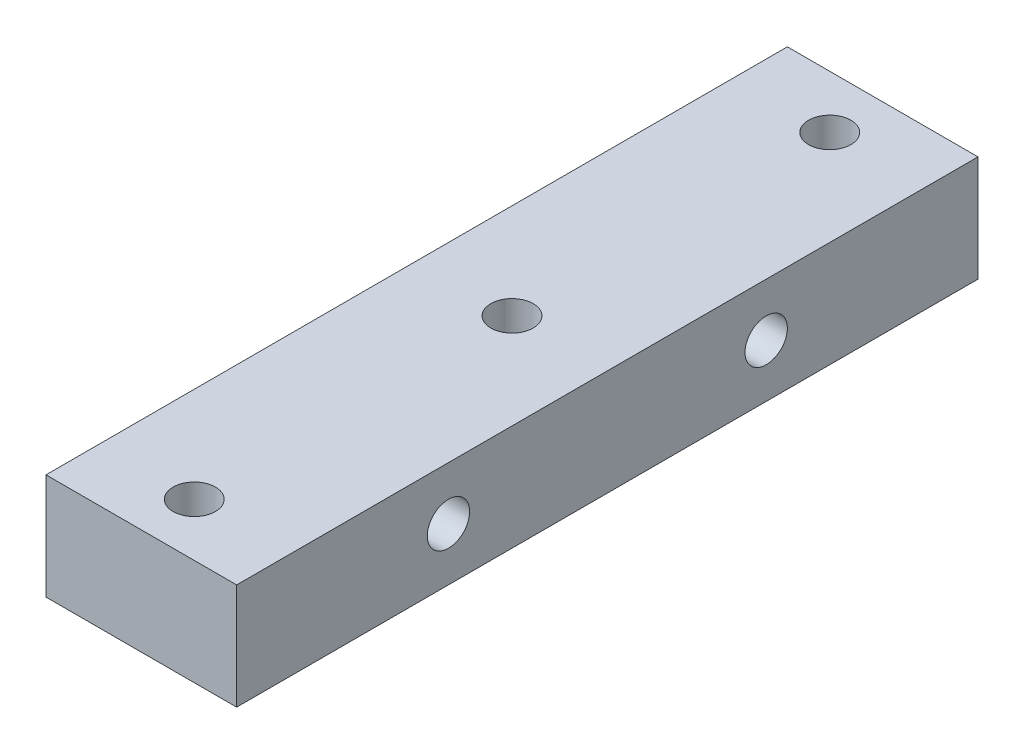
ISO-10303-21;
HEADER;
FILE_DESCRIPTION(('STEP AP214'),'2;1');
FILE_NAME('part.step','',(''),(''),'','','');
FILE_SCHEMA(('AUTOMOTIVE_DESIGN { 1 0 10303 214 1 1 1 1 }'));
ENDSEC;
DATA;
#1=APPLICATION_CONTEXT('core data for automotive mechanical design processes');
#2=APPLICATION_PROTOCOL_DEFINITION('international standard','automotive_design',2000,#1);
#3=PRODUCT_CONTEXT('',#1,'mechanical');
#4=PRODUCT('Part','Part','',(#3));
#5=PRODUCT_RELATED_PRODUCT_CATEGORY('part','',(#4));
#6=PRODUCT_DEFINITION_FORMATION('','',#4);
#7=PRODUCT_DEFINITION_CONTEXT('part definition',#1,'design');
#8=PRODUCT_DEFINITION('design','',#6,#7);
#9=PRODUCT_DEFINITION_SHAPE('','',#8);
#10=(LENGTH_UNIT() NAMED_UNIT(*) SI_UNIT(.MILLI.,.METRE.));
#11=(NAMED_UNIT(*) PLANE_ANGLE_UNIT() SI_UNIT($,.RADIAN.));
#12=(NAMED_UNIT(*) SI_UNIT($,.STERADIAN.) SOLID_ANGLE_UNIT());
#13=UNCERTAINTY_MEASURE_WITH_UNIT(LENGTH_MEASURE(1.E-05),#10,'distance_accuracy_value','');
#14=(GEOMETRIC_REPRESENTATION_CONTEXT(3) GLOBAL_UNCERTAINTY_ASSIGNED_CONTEXT((#13)) GLOBAL_UNIT_ASSIGNED_CONTEXT((#10,
#11,#12)) REPRESENTATION_CONTEXT('',''));
#15=CARTESIAN_POINT('',(0.,0.,0.));
#16=DIRECTION('',(0.,0.,1.));
#17=DIRECTION('',(1.,0.,0.));
#18=AXIS2_PLACEMENT_3D('',#15,#16,#17);
#19=CARTESIAN_POINT('',(9.,5.,70.));
#20=DIRECTION('',(-1.,0.,0.));
#21=DIRECTION('',(0.,0.,1.));
#22=AXIS2_PLACEMENT_3D('',#19,#20,#21);
#23=PLANE('',#22);
#24=CARTESIAN_POINT('',(9.,0.,50.));
#25=DIRECTION('',(1.,0.,0.));
#26=DIRECTION('',(0.,0.,-1.));
#27=AXIS2_PLACEMENT_3D('',#24,#25,#26);
#28=CIRCLE('',#27,2.);
#29=CARTESIAN_POINT('',(9.,0.,48.));
#30=VERTEX_POINT('',#29);
#31=EDGE_CURVE('E139',#30,#30,#28,.T.);
#32=ORIENTED_EDGE('',*,*,#31,.F.);
#33=EDGE_LOOP('',(#32));
#34=FACE_BOUND('',#33,.T.);
#35=CARTESIAN_POINT('',(9.,0.,20.));
#36=DIRECTION('',(1.,0.,0.));
#37=DIRECTION('',(0.,0.,1.));
#38=AXIS2_PLACEMENT_3D('',#35,#36,#37);
#39=CIRCLE('',#38,2.);
#40=CARTESIAN_POINT('',(9.,0.,22.));
#41=VERTEX_POINT('',#40);
#42=EDGE_CURVE('E133',#41,#41,#39,.T.);
#43=ORIENTED_EDGE('',*,*,#42,.F.);
#44=EDGE_LOOP('',(#43));
#45=FACE_BOUND('',#44,.T.);
#46=DIRECTION('',(0.,1.,0.));
#47=VECTOR('',#46,1.);
#48=CARTESIAN_POINT('',(9.,5.,0.));
#49=LINE('',#48,#47);
#50=CARTESIAN_POINT('',(9.,-5.,0.));
#51=VERTEX_POINT('',#50);
#52=CARTESIAN_POINT('',(9.,5.,0.));
#53=VERTEX_POINT('',#52);
#54=EDGE_CURVE('E101',#51,#53,#49,.T.);
#55=ORIENTED_EDGE('',*,*,#54,.T.);
#56=DIRECTION('',(0.,0.,-1.));
#57=VECTOR('',#56,1.);
#58=CARTESIAN_POINT('',(9.,5.,70.));
#59=LINE('',#58,#57);
#60=CARTESIAN_POINT('',(9.,5.,70.));
#61=VERTEX_POINT('',#60);
#62=EDGE_CURVE('E11',#61,#53,#59,.T.);
#63=ORIENTED_EDGE('',*,*,#62,.F.);
#64=DIRECTION('',(0.,1.,0.));
#65=VECTOR('',#64,1.);
#66=CARTESIAN_POINT('',(9.,5.,70.));
#67=LINE('',#66,#65);
#68=CARTESIAN_POINT('',(9.,-5.,70.));
#69=VERTEX_POINT('',#68);
#70=EDGE_CURVE('E89',#69,#61,#67,.T.);
#71=ORIENTED_EDGE('',*,*,#70,.F.);
#72=DIRECTION('',(0.,0.,-1.));
#73=VECTOR('',#72,1.);
#74=CARTESIAN_POINT('',(9.,-5.,70.));
#75=LINE('',#74,#73);
#76=EDGE_CURVE('E97',#69,#51,#75,.T.);
#77=ORIENTED_EDGE('',*,*,#76,.T.);
#78=EDGE_LOOP('',(#55,#63,#71,#77));
#79=FACE_BOUND('',#78,.T.);
#80=ADVANCED_FACE('F38',(#34,#45,#79),#23,.F.);
#81=CARTESIAN_POINT('',(-9.,5.,70.));
#82=DIRECTION('',(0.,-1.,0.));
#83=DIRECTION('',(0.,0.,-1.));
#84=AXIS2_PLACEMENT_3D('',#81,#82,#83);
#85=PLANE('',#84);
#86=CARTESIAN_POINT('',(0.,5.,5.));
#87=DIRECTION('',(0.,1.,0.));
#88=DIRECTION('',(0.,0.,1.));
#89=AXIS2_PLACEMENT_3D('',#86,#87,#88);
#90=CIRCLE('',#89,2.);
#91=CARTESIAN_POINT('',(0.,5.,7.));
#92=VERTEX_POINT('',#91);
#93=EDGE_CURVE('E128',#92,#92,#90,.T.);
#94=ORIENTED_EDGE('',*,*,#93,.F.);
#95=EDGE_LOOP('',(#94));
#96=FACE_BOUND('',#95,.T.);
#97=CARTESIAN_POINT('',(0.,5.,35.));
#98=DIRECTION('',(0.,1.,0.));
#99=DIRECTION('',(0.,0.,1.));
#100=AXIS2_PLACEMENT_3D('',#97,#98,#99);
#101=CIRCLE('',#100,2.);
#102=CARTESIAN_POINT('',(0.,5.,37.));
#103=VERTEX_POINT('',#102);
#104=EDGE_CURVE('E122',#103,#103,#101,.T.);
#105=ORIENTED_EDGE('',*,*,#104,.F.);
#106=EDGE_LOOP('',(#105));
#107=FACE_BOUND('',#106,.T.);
#108=CARTESIAN_POINT('',(0.,5.,65.));
#109=DIRECTION('',(0.,1.,0.));
#110=DIRECTION('',(0.,0.,-1.));
#111=AXIS2_PLACEMENT_3D('',#108,#109,#110);
#112=CIRCLE('',#111,2.);
#113=CARTESIAN_POINT('',(0.,5.,63.));
#114=VERTEX_POINT('',#113);
#115=EDGE_CURVE('E115',#114,#114,#112,.T.);
#116=ORIENTED_EDGE('',*,*,#115,.F.);
#117=EDGE_LOOP('',(#116));
#118=FACE_BOUND('',#117,.T.);
#119=DIRECTION('',(-1.,0.,0.));
#120=VECTOR('',#119,1.);
#121=CARTESIAN_POINT('',(-9.,5.,0.));
#122=LINE('',#121,#120);
#123=CARTESIAN_POINT('',(-9.,5.,0.));
#124=VERTEX_POINT('',#123);
#125=EDGE_CURVE('E93',#53,#124,#122,.T.);
#126=ORIENTED_EDGE('',*,*,#125,.T.);
#127=DIRECTION('',(0.,0.,-1.));
#128=VECTOR('',#127,1.);
#129=CARTESIAN_POINT('',(-9.,5.,70.));
#130=LINE('',#129,#128);
#131=CARTESIAN_POINT('',(-9.,5.,70.));
#132=VERTEX_POINT('',#131);
#133=EDGE_CURVE('E46',#132,#124,#130,.T.);
#134=ORIENTED_EDGE('',*,*,#133,.F.);
#135=DIRECTION('',(-1.,0.,0.));
#136=VECTOR('',#135,1.);
#137=CARTESIAN_POINT('',(-9.,5.,70.));
#138=LINE('',#137,#136);
#139=EDGE_CURVE('E84',#61,#132,#138,.T.);
#140=ORIENTED_EDGE('',*,*,#139,.F.);
#141=ORIENTED_EDGE('',*,*,#62,.T.);
#142=EDGE_LOOP('',(#126,#134,#140,#141));
#143=FACE_BOUND('',#142,.T.);
#144=ADVANCED_FACE('F92',(#96,#107,#118,#143),#85,.F.);
#145=CARTESIAN_POINT('',(-9.,5.,70.));
#146=DIRECTION('',(1.,0.,0.));
#147=DIRECTION('',(0.,0.,-1.));
#148=AXIS2_PLACEMENT_3D('',#145,#146,#147);
#149=PLANE('',#148);
#150=CARTESIAN_POINT('',(-9.,0.,50.));
#151=DIRECTION('',(1.,0.,0.));
#152=DIRECTION('',(0.,0.,-1.));
#153=AXIS2_PLACEMENT_3D('',#150,#151,#152);
#154=CIRCLE('',#153,2.);
#155=CARTESIAN_POINT('',(-9.,0.,48.));
#156=VERTEX_POINT('',#155);
#157=EDGE_CURVE('E119',#156,#156,#154,.T.);
#158=ORIENTED_EDGE('',*,*,#157,.T.);
#159=EDGE_LOOP('',(#158));
#160=FACE_BOUND('',#159,.T.);
#161=CARTESIAN_POINT('',(-9.,0.,20.));
#162=DIRECTION('',(1.,0.,0.));
#163=DIRECTION('',(0.,0.,1.));
#164=AXIS2_PLACEMENT_3D('',#161,#162,#163);
#165=CIRCLE('',#164,2.);
#166=CARTESIAN_POINT('',(-9.,0.,22.));
#167=VERTEX_POINT('',#166);
#168=EDGE_CURVE('E136',#167,#167,#165,.T.);
#169=ORIENTED_EDGE('',*,*,#168,.T.);
#170=EDGE_LOOP('',(#169));
#171=FACE_BOUND('',#170,.T.);
#172=DIRECTION('',(0.,-1.,0.));
#173=VECTOR('',#172,1.);
#174=CARTESIAN_POINT('',(-9.,5.,0.));
#175=LINE('',#174,#173);
#176=CARTESIAN_POINT('',(-9.,-5.,0.));
#177=VERTEX_POINT('',#176);
#178=EDGE_CURVE('E71',#124,#177,#175,.T.);
#179=ORIENTED_EDGE('',*,*,#178,.T.);
#180=DIRECTION('',(0.,0.,-1.));
#181=VECTOR('',#180,1.);
#182=CARTESIAN_POINT('',(-9.,-5.,70.));
#183=LINE('',#182,#181);
#184=CARTESIAN_POINT('',(-9.,-5.,70.));
#185=VERTEX_POINT('',#184);
#186=EDGE_CURVE('E94',#185,#177,#183,.T.);
#187=ORIENTED_EDGE('',*,*,#186,.F.);
#188=DIRECTION('',(0.,-1.,0.));
#189=VECTOR('',#188,1.);
#190=CARTESIAN_POINT('',(-9.,5.,70.));
#191=LINE('',#190,#189);
#192=EDGE_CURVE('E87',#132,#185,#191,.T.);
#193=ORIENTED_EDGE('',*,*,#192,.F.);
#194=ORIENTED_EDGE('',*,*,#133,.T.);
#195=EDGE_LOOP('',(#179,#187,#193,#194));
#196=FACE_BOUND('',#195,.T.);
#197=ADVANCED_FACE('F95',(#160,#171,#196),#149,.F.);
#198=CARTESIAN_POINT('',(-9.,-5.,70.));
#199=DIRECTION('',(0.,1.,0.));
#200=DIRECTION('',(0.,0.,1.));
#201=AXIS2_PLACEMENT_3D('',#198,#199,#200);
#202=PLANE('',#201);
#203=CARTESIAN_POINT('',(0.,-5.,5.));
#204=DIRECTION('',(0.,1.,0.));
#205=DIRECTION('',(0.,0.,1.));
#206=AXIS2_PLACEMENT_3D('',#203,#204,#205);
#207=CIRCLE('',#206,2.);
#208=CARTESIAN_POINT('',(0.,-5.,7.));
#209=VERTEX_POINT('',#208);
#210=EDGE_CURVE('E104',#209,#209,#207,.T.);
#211=ORIENTED_EDGE('',*,*,#210,.T.);
#212=EDGE_LOOP('',(#211));
#213=FACE_BOUND('',#212,.T.);
#214=CARTESIAN_POINT('',(0.,-5.,35.));
#215=DIRECTION('',(0.,1.,0.));
#216=DIRECTION('',(0.,0.,1.));
#217=AXIS2_PLACEMENT_3D('',#214,#215,#216);
#218=CIRCLE('',#217,2.);
#219=CARTESIAN_POINT('',(0.,-5.,37.));
#220=VERTEX_POINT('',#219);
#221=EDGE_CURVE('E125',#220,#220,#218,.T.);
#222=ORIENTED_EDGE('',*,*,#221,.T.);
#223=EDGE_LOOP('',(#222));
#224=FACE_BOUND('',#223,.T.);
#225=CARTESIAN_POINT('',(0.,-5.,65.));
#226=DIRECTION('',(0.,1.,0.));
#227=DIRECTION('',(0.,0.,-1.));
#228=AXIS2_PLACEMENT_3D('',#225,#226,#227);
#229=CIRCLE('',#228,2.);
#230=CARTESIAN_POINT('',(0.,-5.,63.));
#231=VERTEX_POINT('',#230);
#232=EDGE_CURVE('E118',#231,#231,#229,.T.);
#233=ORIENTED_EDGE('',*,*,#232,.T.);
#234=EDGE_LOOP('',(#233));
#235=FACE_BOUND('',#234,.T.);
#236=DIRECTION('',(1.,0.,0.));
#237=VECTOR('',#236,1.);
#238=CARTESIAN_POINT('',(-9.,-5.,0.));
#239=LINE('',#238,#237);
#240=EDGE_CURVE('E77',#177,#51,#239,.T.);
#241=ORIENTED_EDGE('',*,*,#240,.T.);
#242=ORIENTED_EDGE('',*,*,#76,.F.);
#243=DIRECTION('',(1.,0.,0.));
#244=VECTOR('',#243,1.);
#245=CARTESIAN_POINT('',(-9.,-5.,70.));
#246=LINE('',#245,#244);
#247=EDGE_CURVE('E54',#185,#69,#246,.T.);
#248=ORIENTED_EDGE('',*,*,#247,.F.);
#249=ORIENTED_EDGE('',*,*,#186,.T.);
#250=EDGE_LOOP('',(#241,#242,#248,#249));
#251=FACE_BOUND('',#250,.T.);
#252=ADVANCED_FACE('F109',(#213,#224,#235,#251),#202,.F.);
#253=CARTESIAN_POINT('',(0.,0.,70.));
#254=DIRECTION('',(0.,0.,1.));
#255=DIRECTION('',(1.,0.,0.));
#256=AXIS2_PLACEMENT_3D('',#253,#254,#255);
#257=PLANE('',#256);
#258=ORIENTED_EDGE('',*,*,#70,.T.);
#259=ORIENTED_EDGE('',*,*,#139,.T.);
#260=ORIENTED_EDGE('',*,*,#192,.T.);
#261=ORIENTED_EDGE('',*,*,#247,.T.);
#262=EDGE_LOOP('',(#258,#259,#260,#261));
#263=FACE_BOUND('',#262,.T.);
#264=ADVANCED_FACE('F85',(#263),#257,.T.);
#265=CARTESIAN_POINT('',(0.,0.,0.));
#266=DIRECTION('',(0.,0.,1.));
#267=DIRECTION('',(1.,0.,0.));
#268=AXIS2_PLACEMENT_3D('',#265,#266,#267);
#269=PLANE('',#268);
#270=ORIENTED_EDGE('',*,*,#54,.F.);
#271=ORIENTED_EDGE('',*,*,#240,.F.);
#272=ORIENTED_EDGE('',*,*,#178,.F.);
#273=ORIENTED_EDGE('',*,*,#125,.F.);
#274=EDGE_LOOP('',(#270,#271,#272,#273));
#275=FACE_BOUND('',#274,.T.);
#276=ADVANCED_FACE('F112',(#275),#269,.F.);
#277=CARTESIAN_POINT('',(0.,-5.,65.));
#278=DIRECTION('',(0.,1.,0.));
#279=DIRECTION('',(0.,0.,1.));
#280=AXIS2_PLACEMENT_3D('',#277,#278,#279);
#281=CYLINDRICAL_SURFACE('',#280,2.);
#282=ORIENTED_EDGE('',*,*,#232,.F.);
#283=EDGE_LOOP('',(#282));
#284=FACE_BOUND('',#283,.T.);
#285=ORIENTED_EDGE('',*,*,#115,.T.);
#286=EDGE_LOOP('',(#285));
#287=FACE_BOUND('',#286,.T.);
#288=ADVANCED_FACE('F172',(#284,#287),#281,.F.);
#289=CARTESIAN_POINT('',(0.,-5.,35.));
#290=DIRECTION('',(0.,1.,0.));
#291=DIRECTION('',(0.,0.,1.));
#292=AXIS2_PLACEMENT_3D('',#289,#290,#291);
#293=CYLINDRICAL_SURFACE('',#292,2.);
#294=ORIENTED_EDGE('',*,*,#221,.F.);
#295=EDGE_LOOP('',(#294));
#296=FACE_BOUND('',#295,.T.);
#297=ORIENTED_EDGE('',*,*,#104,.T.);
#298=EDGE_LOOP('',(#297));
#299=FACE_BOUND('',#298,.T.);
#300=ADVANCED_FACE('F165',(#296,#299),#293,.F.);
#301=CARTESIAN_POINT('',(0.,-5.,5.));
#302=DIRECTION('',(0.,1.,0.));
#303=DIRECTION('',(0.,0.,1.));
#304=AXIS2_PLACEMENT_3D('',#301,#302,#303);
#305=CYLINDRICAL_SURFACE('',#304,2.);
#306=ORIENTED_EDGE('',*,*,#210,.F.);
#307=EDGE_LOOP('',(#306));
#308=FACE_BOUND('',#307,.T.);
#309=ORIENTED_EDGE('',*,*,#93,.T.);
#310=EDGE_LOOP('',(#309));
#311=FACE_BOUND('',#310,.T.);
#312=ADVANCED_FACE('F159',(#308,#311),#305,.F.);
#313=CARTESIAN_POINT('',(-9.,0.,20.));
#314=DIRECTION('',(1.,0.,0.));
#315=DIRECTION('',(0.,0.,-1.));
#316=AXIS2_PLACEMENT_3D('',#313,#314,#315);
#317=CYLINDRICAL_SURFACE('',#316,2.);
#318=ORIENTED_EDGE('',*,*,#168,.F.);
#319=EDGE_LOOP('',(#318));
#320=FACE_BOUND('',#319,.T.);
#321=ORIENTED_EDGE('',*,*,#42,.T.);
#322=EDGE_LOOP('',(#321));
#323=FACE_BOUND('',#322,.T.);
#324=ADVANCED_FACE('F150',(#320,#323),#317,.F.);
#325=CARTESIAN_POINT('',(-9.,0.,50.));
#326=DIRECTION('',(1.,0.,0.));
#327=DIRECTION('',(0.,0.,-1.));
#328=AXIS2_PLACEMENT_3D('',#325,#326,#327);
#329=CYLINDRICAL_SURFACE('',#328,2.);
#330=ORIENTED_EDGE('',*,*,#157,.F.);
#331=EDGE_LOOP('',(#330));
#332=FACE_BOUND('',#331,.T.);
#333=ORIENTED_EDGE('',*,*,#31,.T.);
#334=EDGE_LOOP('',(#333));
#335=FACE_BOUND('',#334,.T.);
#336=ADVANCED_FACE('F147',(#332,#335),#329,.F.);
#337=CLOSED_SHELL('',(#80,#144,#197,#252,#264,#276,#288,#300,#312,#324,#336));
#338=MANIFOLD_SOLID_BREP('B2',#337);
#339=ADVANCED_BREP_SHAPE_REPRESENTATION('',(#18,#338),#14);
#340=SHAPE_DEFINITION_REPRESENTATION(#9,#339);
ENDSEC;
END-ISO-10303-21;
